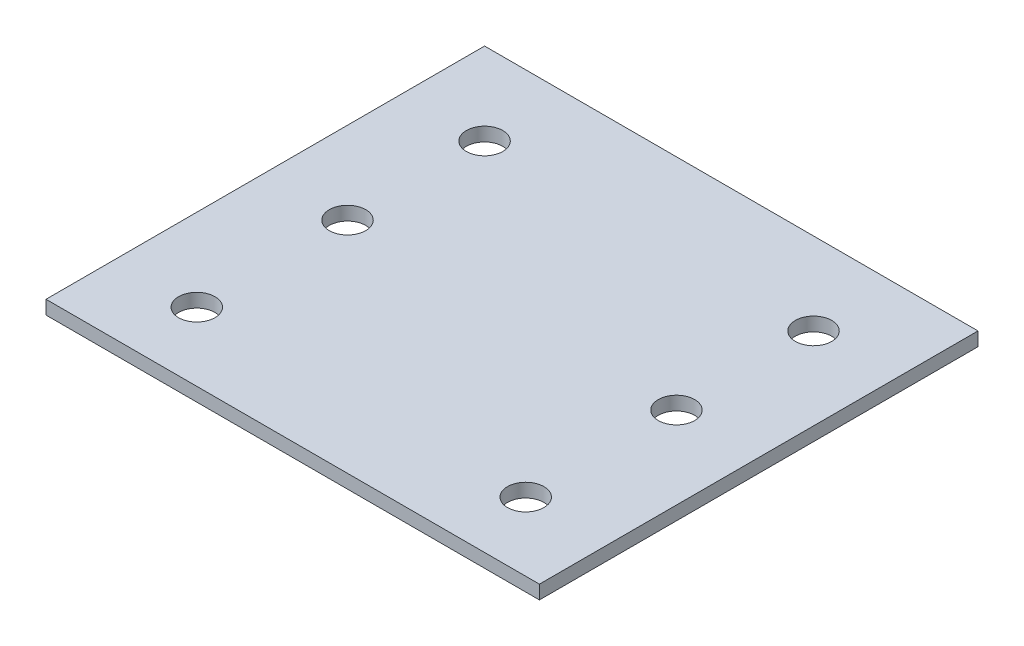
ISO-10303-21;
HEADER;
FILE_DESCRIPTION(('STEP AP214'),'2;1');
FILE_NAME('part.step','',(''),(''),'','','');
FILE_SCHEMA(('AUTOMOTIVE_DESIGN { 1 0 10303 214 1 1 1 1 }'));
ENDSEC;
DATA;
#1=APPLICATION_CONTEXT('core data for automotive mechanical design processes');
#2=APPLICATION_PROTOCOL_DEFINITION('international standard','automotive_design',2000,#1);
#3=PRODUCT_CONTEXT('',#1,'mechanical');
#4=PRODUCT('Part','Part','',(#3));
#5=PRODUCT_RELATED_PRODUCT_CATEGORY('part','',(#4));
#6=PRODUCT_DEFINITION_FORMATION('','',#4);
#7=PRODUCT_DEFINITION_CONTEXT('part definition',#1,'design');
#8=PRODUCT_DEFINITION('design','',#6,#7);
#9=PRODUCT_DEFINITION_SHAPE('','',#8);
#10=(LENGTH_UNIT() NAMED_UNIT(*) SI_UNIT(.MILLI.,.METRE.));
#11=(NAMED_UNIT(*) PLANE_ANGLE_UNIT() SI_UNIT($,.RADIAN.));
#12=(NAMED_UNIT(*) SI_UNIT($,.STERADIAN.) SOLID_ANGLE_UNIT());
#13=UNCERTAINTY_MEASURE_WITH_UNIT(LENGTH_MEASURE(1.E-05),#10,'distance_accuracy_value','');
#14=(GEOMETRIC_REPRESENTATION_CONTEXT(3) GLOBAL_UNCERTAINTY_ASSIGNED_CONTEXT((#13)) GLOBAL_UNIT_ASSIGNED_CONTEXT((#10,
#11,#12)) REPRESENTATION_CONTEXT('',''));
#15=CARTESIAN_POINT('',(0.,0.,0.));
#16=DIRECTION('',(0.,0.,1.));
#17=DIRECTION('',(1.,0.,0.));
#18=AXIS2_PLACEMENT_3D('',#15,#16,#17);
#19=CARTESIAN_POINT('',(57.15,3.175,-50.8));
#20=DIRECTION('',(-1.,0.,0.));
#21=DIRECTION('',(0.,0.,1.));
#22=AXIS2_PLACEMENT_3D('',#19,#20,#21);
#23=PLANE('',#22);
#24=DIRECTION('',(0.,0.,-1.));
#25=VECTOR('',#24,1.);
#26=CARTESIAN_POINT('',(57.15,0.,-50.8));
#27=LINE('',#26,#25);
#28=CARTESIAN_POINT('',(57.15,0.,50.8));
#29=VERTEX_POINT('',#28);
#30=CARTESIAN_POINT('',(57.15,0.,-50.8));
#31=VERTEX_POINT('',#30);
#32=EDGE_CURVE('E102',#29,#31,#27,.T.);
#33=ORIENTED_EDGE('',*,*,#32,.T.);
#34=DIRECTION('',(0.,-1.,0.));
#35=VECTOR('',#34,1.);
#36=CARTESIAN_POINT('',(57.15,3.175,-50.8));
#37=LINE('',#36,#35);
#38=CARTESIAN_POINT('',(57.15,3.175,-50.8));
#39=VERTEX_POINT('',#38);
#40=EDGE_CURVE('E11',#39,#31,#37,.T.);
#41=ORIENTED_EDGE('',*,*,#40,.F.);
#42=DIRECTION('',(0.,0.,-1.));
#43=VECTOR('',#42,1.);
#44=CARTESIAN_POINT('',(57.15,3.175,-50.8));
#45=LINE('',#44,#43);
#46=CARTESIAN_POINT('',(57.15,3.175,50.8));
#47=VERTEX_POINT('',#46);
#48=EDGE_CURVE('E90',#47,#39,#45,.T.);
#49=ORIENTED_EDGE('',*,*,#48,.F.);
#50=DIRECTION('',(0.,-1.,0.));
#51=VECTOR('',#50,1.);
#52=CARTESIAN_POINT('',(57.15,3.175,50.8));
#53=LINE('',#52,#51);
#54=EDGE_CURVE('E98',#47,#29,#53,.T.);
#55=ORIENTED_EDGE('',*,*,#54,.T.);
#56=EDGE_LOOP('',(#33,#41,#49,#55));
#57=FACE_BOUND('',#56,.T.);
#58=ADVANCED_FACE('F39',(#57),#23,.F.);
#59=CARTESIAN_POINT('',(-57.15,3.175,-50.8));
#60=DIRECTION('',(0.,0.,1.));
#61=DIRECTION('',(1.,0.,0.));
#62=AXIS2_PLACEMENT_3D('',#59,#60,#61);
#63=PLANE('',#62);
#64=DIRECTION('',(-1.,0.,0.));
#65=VECTOR('',#64,1.);
#66=CARTESIAN_POINT('',(-57.15,0.,-50.8));
#67=LINE('',#66,#65);
#68=CARTESIAN_POINT('',(-57.15,0.,-50.8));
#69=VERTEX_POINT('',#68);
#70=EDGE_CURVE('E94',#31,#69,#67,.T.);
#71=ORIENTED_EDGE('',*,*,#70,.T.);
#72=DIRECTION('',(0.,-1.,0.));
#73=VECTOR('',#72,1.);
#74=CARTESIAN_POINT('',(-57.15,3.175,-50.8));
#75=LINE('',#74,#73);
#76=CARTESIAN_POINT('',(-57.15,3.175,-50.8));
#77=VERTEX_POINT('',#76);
#78=EDGE_CURVE('E47',#77,#69,#75,.T.);
#79=ORIENTED_EDGE('',*,*,#78,.F.);
#80=DIRECTION('',(-1.,0.,0.));
#81=VECTOR('',#80,1.);
#82=CARTESIAN_POINT('',(-57.15,3.175,-50.8));
#83=LINE('',#82,#81);
#84=EDGE_CURVE('E85',#39,#77,#83,.T.);
#85=ORIENTED_EDGE('',*,*,#84,.F.);
#86=ORIENTED_EDGE('',*,*,#40,.T.);
#87=EDGE_LOOP('',(#71,#79,#85,#86));
#88=FACE_BOUND('',#87,.T.);
#89=ADVANCED_FACE('F93',(#88),#63,.F.);
#90=CARTESIAN_POINT('',(-57.15,3.175,-50.8));
#91=DIRECTION('',(1.,0.,0.));
#92=DIRECTION('',(0.,0.,-1.));
#93=AXIS2_PLACEMENT_3D('',#90,#91,#92);
#94=PLANE('',#93);
#95=DIRECTION('',(0.,0.,1.));
#96=VECTOR('',#95,1.);
#97=CARTESIAN_POINT('',(-57.15,0.,-50.8));
#98=LINE('',#97,#96);
#99=CARTESIAN_POINT('',(-57.15,0.,50.8));
#100=VERTEX_POINT('',#99);
#101=EDGE_CURVE('E72',#69,#100,#98,.T.);
#102=ORIENTED_EDGE('',*,*,#101,.T.);
#103=DIRECTION('',(0.,-1.,0.));
#104=VECTOR('',#103,1.);
#105=CARTESIAN_POINT('',(-57.15,3.175,50.8));
#106=LINE('',#105,#104);
#107=CARTESIAN_POINT('',(-57.15,3.175,50.8));
#108=VERTEX_POINT('',#107);
#109=EDGE_CURVE('E95',#108,#100,#106,.T.);
#110=ORIENTED_EDGE('',*,*,#109,.F.);
#111=DIRECTION('',(0.,0.,1.));
#112=VECTOR('',#111,1.);
#113=CARTESIAN_POINT('',(-57.15,3.175,-50.8));
#114=LINE('',#113,#112);
#115=EDGE_CURVE('E88',#77,#108,#114,.T.);
#116=ORIENTED_EDGE('',*,*,#115,.F.);
#117=ORIENTED_EDGE('',*,*,#78,.T.);
#118=EDGE_LOOP('',(#102,#110,#116,#117));
#119=FACE_BOUND('',#118,.T.);
#120=ADVANCED_FACE('F96',(#119),#94,.F.);
#121=CARTESIAN_POINT('',(-57.15,3.175,50.8));
#122=DIRECTION('',(0.,0.,-1.));
#123=DIRECTION('',(-1.,0.,0.));
#124=AXIS2_PLACEMENT_3D('',#121,#122,#123);
#125=PLANE('',#124);
#126=DIRECTION('',(1.,0.,0.));
#127=VECTOR('',#126,1.);
#128=CARTESIAN_POINT('',(-57.15,0.,50.8));
#129=LINE('',#128,#127);
#130=EDGE_CURVE('E78',#100,#29,#129,.T.);
#131=ORIENTED_EDGE('',*,*,#130,.T.);
#132=ORIENTED_EDGE('',*,*,#54,.F.);
#133=DIRECTION('',(1.,0.,0.));
#134=VECTOR('',#133,1.);
#135=CARTESIAN_POINT('',(-57.15,3.175,50.8));
#136=LINE('',#135,#134);
#137=EDGE_CURVE('E55',#108,#47,#136,.T.);
#138=ORIENTED_EDGE('',*,*,#137,.F.);
#139=ORIENTED_EDGE('',*,*,#109,.T.);
#140=EDGE_LOOP('',(#131,#132,#138,#139));
#141=FACE_BOUND('',#140,.T.);
#142=ADVANCED_FACE('F110',(#141),#125,.F.);
#143=CARTESIAN_POINT('',(0.,3.175,0.));
#144=DIRECTION('',(0.,1.,0.));
#145=DIRECTION('',(0.,0.,1.));
#146=AXIS2_PLACEMENT_3D('',#143,#144,#145);
#147=PLANE('',#146);
#148=CARTESIAN_POINT('',(38.1,3.175,-31.75));
#149=DIRECTION('',(0.,1.,0.));
#150=DIRECTION('',(0.,0.,1.));
#151=AXIS2_PLACEMENT_3D('',#148,#149,#150);
#152=CIRCLE('',#151,4.21639999999999);
#153=CARTESIAN_POINT('',(38.1,3.175,-27.5336));
#154=VERTEX_POINT('',#153);
#155=EDGE_CURVE('E148',#154,#154,#152,.T.);
#156=ORIENTED_EDGE('',*,*,#155,.F.);
#157=EDGE_LOOP('',(#156));
#158=FACE_BOUND('',#157,.T.);
#159=CARTESIAN_POINT('',(38.1,3.175,0.));
#160=DIRECTION('',(0.,1.,0.));
#161=DIRECTION('',(0.,0.,1.));
#162=AXIS2_PLACEMENT_3D('',#159,#160,#161);
#163=CIRCLE('',#162,4.21639999999999);
#164=CARTESIAN_POINT('',(38.1,3.175,4.21639999999999));
#165=VERTEX_POINT('',#164);
#166=EDGE_CURVE('E142',#165,#165,#163,.T.);
#167=ORIENTED_EDGE('',*,*,#166,.F.);
#168=EDGE_LOOP('',(#167));
#169=FACE_BOUND('',#168,.T.);
#170=CARTESIAN_POINT('',(38.1,3.175,34.925));
#171=DIRECTION('',(0.,1.,0.));
#172=DIRECTION('',(0.,0.,1.));
#173=AXIS2_PLACEMENT_3D('',#170,#171,#172);
#174=CIRCLE('',#173,4.21639999999999);
#175=CARTESIAN_POINT('',(38.1,3.175,39.1414));
#176=VERTEX_POINT('',#175);
#177=EDGE_CURVE('E136',#176,#176,#174,.T.);
#178=ORIENTED_EDGE('',*,*,#177,.F.);
#179=EDGE_LOOP('',(#178));
#180=FACE_BOUND('',#179,.T.);
#181=CARTESIAN_POINT('',(-38.1,3.175,-31.75));
#182=DIRECTION('',(0.,1.,0.));
#183=DIRECTION('',(0.,0.,1.));
#184=AXIS2_PLACEMENT_3D('',#181,#182,#183);
#185=CIRCLE('',#184,4.21639999999999);
#186=CARTESIAN_POINT('',(-38.1,3.175,-27.5336));
#187=VERTEX_POINT('',#186);
#188=EDGE_CURVE('E130',#187,#187,#185,.T.);
#189=ORIENTED_EDGE('',*,*,#188,.F.);
#190=EDGE_LOOP('',(#189));
#191=FACE_BOUND('',#190,.T.);
#192=CARTESIAN_POINT('',(-38.1,3.175,0.));
#193=DIRECTION('',(0.,1.,0.));
#194=DIRECTION('',(0.,0.,1.));
#195=AXIS2_PLACEMENT_3D('',#192,#193,#194);
#196=CIRCLE('',#195,4.21639999999999);
#197=CARTESIAN_POINT('',(-38.1,3.175,4.21639999999999));
#198=VERTEX_POINT('',#197);
#199=EDGE_CURVE('E124',#198,#198,#196,.T.);
#200=ORIENTED_EDGE('',*,*,#199,.F.);
#201=EDGE_LOOP('',(#200));
#202=FACE_BOUND('',#201,.T.);
#203=CARTESIAN_POINT('',(-38.1,3.175,34.925));
#204=DIRECTION('',(0.,1.,0.));
#205=DIRECTION('',(0.,0.,1.));
#206=AXIS2_PLACEMENT_3D('',#203,#204,#205);
#207=CIRCLE('',#206,4.21639999999999);
#208=CARTESIAN_POINT('',(-38.1,3.175,39.1414));
#209=VERTEX_POINT('',#208);
#210=EDGE_CURVE('E118',#209,#209,#207,.T.);
#211=ORIENTED_EDGE('',*,*,#210,.F.);
#212=EDGE_LOOP('',(#211));
#213=FACE_BOUND('',#212,.T.);
#214=ORIENTED_EDGE('',*,*,#48,.T.);
#215=ORIENTED_EDGE('',*,*,#84,.T.);
#216=ORIENTED_EDGE('',*,*,#115,.T.);
#217=ORIENTED_EDGE('',*,*,#137,.T.);
#218=EDGE_LOOP('',(#214,#215,#216,#217));
#219=FACE_BOUND('',#218,.T.);
#220=ADVANCED_FACE('F86',(#158,#169,#180,#191,#202,#213,#219),#147,.T.);
#221=CARTESIAN_POINT('',(0.,0.,0.));
#222=DIRECTION('',(0.,1.,0.));
#223=DIRECTION('',(0.,0.,1.));
#224=AXIS2_PLACEMENT_3D('',#221,#222,#223);
#225=PLANE('',#224);
#226=CARTESIAN_POINT('',(38.1,0.,-31.75));
#227=DIRECTION('',(0.,1.,0.));
#228=DIRECTION('',(0.,0.,1.));
#229=AXIS2_PLACEMENT_3D('',#226,#227,#228);
#230=CIRCLE('',#229,4.21639999999999);
#231=CARTESIAN_POINT('',(38.1,0.,-27.5336));
#232=VERTEX_POINT('',#231);
#233=EDGE_CURVE('E145',#232,#232,#230,.T.);
#234=ORIENTED_EDGE('',*,*,#233,.T.);
#235=EDGE_LOOP('',(#234));
#236=FACE_BOUND('',#235,.T.);
#237=CARTESIAN_POINT('',(38.1,0.,0.));
#238=DIRECTION('',(0.,1.,0.));
#239=DIRECTION('',(0.,0.,1.));
#240=AXIS2_PLACEMENT_3D('',#237,#238,#239);
#241=CIRCLE('',#240,4.21639999999999);
#242=CARTESIAN_POINT('',(38.1,0.,4.21639999999999));
#243=VERTEX_POINT('',#242);
#244=EDGE_CURVE('E139',#243,#243,#241,.T.);
#245=ORIENTED_EDGE('',*,*,#244,.T.);
#246=EDGE_LOOP('',(#245));
#247=FACE_BOUND('',#246,.T.);
#248=CARTESIAN_POINT('',(38.1,0.,34.925));
#249=DIRECTION('',(0.,1.,0.));
#250=DIRECTION('',(0.,0.,1.));
#251=AXIS2_PLACEMENT_3D('',#248,#249,#250);
#252=CIRCLE('',#251,4.21639999999999);
#253=CARTESIAN_POINT('',(38.1,0.,39.1414));
#254=VERTEX_POINT('',#253);
#255=EDGE_CURVE('E133',#254,#254,#252,.T.);
#256=ORIENTED_EDGE('',*,*,#255,.T.);
#257=EDGE_LOOP('',(#256));
#258=FACE_BOUND('',#257,.T.);
#259=CARTESIAN_POINT('',(-38.1,0.,-31.75));
#260=DIRECTION('',(0.,1.,0.));
#261=DIRECTION('',(0.,0.,1.));
#262=AXIS2_PLACEMENT_3D('',#259,#260,#261);
#263=CIRCLE('',#262,4.21639999999999);
#264=CARTESIAN_POINT('',(-38.1,0.,-27.5336));
#265=VERTEX_POINT('',#264);
#266=EDGE_CURVE('E127',#265,#265,#263,.T.);
#267=ORIENTED_EDGE('',*,*,#266,.T.);
#268=EDGE_LOOP('',(#267));
#269=FACE_BOUND('',#268,.T.);
#270=CARTESIAN_POINT('',(-38.1,0.,0.));
#271=DIRECTION('',(0.,1.,0.));
#272=DIRECTION('',(0.,0.,1.));
#273=AXIS2_PLACEMENT_3D('',#270,#271,#272);
#274=CIRCLE('',#273,4.21639999999999);
#275=CARTESIAN_POINT('',(-38.1,0.,4.21639999999999));
#276=VERTEX_POINT('',#275);
#277=EDGE_CURVE('E121',#276,#276,#274,.T.);
#278=ORIENTED_EDGE('',*,*,#277,.T.);
#279=EDGE_LOOP('',(#278));
#280=FACE_BOUND('',#279,.T.);
#281=CARTESIAN_POINT('',(-38.1,0.,34.925));
#282=DIRECTION('',(0.,1.,0.));
#283=DIRECTION('',(0.,0.,1.));
#284=AXIS2_PLACEMENT_3D('',#281,#282,#283);
#285=CIRCLE('',#284,4.21639999999999);
#286=CARTESIAN_POINT('',(-38.1,0.,39.1414));
#287=VERTEX_POINT('',#286);
#288=EDGE_CURVE('E105',#287,#287,#285,.T.);
#289=ORIENTED_EDGE('',*,*,#288,.T.);
#290=EDGE_LOOP('',(#289));
#291=FACE_BOUND('',#290,.T.);
#292=ORIENTED_EDGE('',*,*,#32,.F.);
#293=ORIENTED_EDGE('',*,*,#130,.F.);
#294=ORIENTED_EDGE('',*,*,#101,.F.);
#295=ORIENTED_EDGE('',*,*,#70,.F.);
#296=EDGE_LOOP('',(#292,#293,#294,#295));
#297=FACE_BOUND('',#296,.T.);
#298=ADVANCED_FACE('F113',(#236,#247,#258,#269,#280,#291,#297),#225,.F.);
#299=CARTESIAN_POINT('',(-38.1,3.175,34.925));
#300=DIRECTION('',(0.,1.,0.));
#301=DIRECTION('',(0.,0.,1.));
#302=AXIS2_PLACEMENT_3D('',#299,#300,#301);
#303=CYLINDRICAL_SURFACE('',#302,4.21639999999999);
#304=ORIENTED_EDGE('',*,*,#288,.F.);
#305=EDGE_LOOP('',(#304));
#306=FACE_BOUND('',#305,.T.);
#307=ORIENTED_EDGE('',*,*,#210,.T.);
#308=EDGE_LOOP('',(#307));
#309=FACE_BOUND('',#308,.T.);
#310=ADVANCED_FACE('F167',(#306,#309),#303,.F.);
#311=CARTESIAN_POINT('',(-38.1,3.175,0.));
#312=DIRECTION('',(0.,1.,0.));
#313=DIRECTION('',(0.,0.,1.));
#314=AXIS2_PLACEMENT_3D('',#311,#312,#313);
#315=CYLINDRICAL_SURFACE('',#314,4.21639999999999);
#316=ORIENTED_EDGE('',*,*,#277,.F.);
#317=EDGE_LOOP('',(#316));
#318=FACE_BOUND('',#317,.T.);
#319=ORIENTED_EDGE('',*,*,#199,.T.);
#320=EDGE_LOOP('',(#319));
#321=FACE_BOUND('',#320,.T.);
#322=ADVANCED_FACE('F169',(#318,#321),#315,.F.);
#323=CARTESIAN_POINT('',(-38.1,3.175,-31.75));
#324=DIRECTION('',(0.,1.,0.));
#325=DIRECTION('',(0.,0.,1.));
#326=AXIS2_PLACEMENT_3D('',#323,#324,#325);
#327=CYLINDRICAL_SURFACE('',#326,4.21639999999999);
#328=ORIENTED_EDGE('',*,*,#266,.F.);
#329=EDGE_LOOP('',(#328));
#330=FACE_BOUND('',#329,.T.);
#331=ORIENTED_EDGE('',*,*,#188,.T.);
#332=EDGE_LOOP('',(#331));
#333=FACE_BOUND('',#332,.T.);
#334=ADVANCED_FACE('F176',(#330,#333),#327,.F.);
#335=CARTESIAN_POINT('',(38.1,3.175,34.925));
#336=DIRECTION('',(0.,1.,0.));
#337=DIRECTION('',(0.,0.,1.));
#338=AXIS2_PLACEMENT_3D('',#335,#336,#337);
#339=CYLINDRICAL_SURFACE('',#338,4.21639999999999);
#340=ORIENTED_EDGE('',*,*,#255,.F.);
#341=EDGE_LOOP('',(#340));
#342=FACE_BOUND('',#341,.T.);
#343=ORIENTED_EDGE('',*,*,#177,.T.);
#344=EDGE_LOOP('',(#343));
#345=FACE_BOUND('',#344,.T.);
#346=ADVANCED_FACE('F213',(#342,#345),#339,.F.);
#347=CARTESIAN_POINT('',(38.1,3.175,0.));
#348=DIRECTION('',(0.,1.,0.));
#349=DIRECTION('',(0.,0.,1.));
#350=AXIS2_PLACEMENT_3D('',#347,#348,#349);
#351=CYLINDRICAL_SURFACE('',#350,4.21639999999999);
#352=ORIENTED_EDGE('',*,*,#244,.F.);
#353=EDGE_LOOP('',(#352));
#354=FACE_BOUND('',#353,.T.);
#355=ORIENTED_EDGE('',*,*,#166,.T.);
#356=EDGE_LOOP('',(#355));
#357=FACE_BOUND('',#356,.T.);
#358=ADVANCED_FACE('F218',(#354,#357),#351,.F.);
#359=CARTESIAN_POINT('',(38.1,3.175,-31.75));
#360=DIRECTION('',(0.,1.,0.));
#361=DIRECTION('',(0.,0.,1.));
#362=AXIS2_PLACEMENT_3D('',#359,#360,#361);
#363=CYLINDRICAL_SURFACE('',#362,4.21639999999999);
#364=ORIENTED_EDGE('',*,*,#233,.F.);
#365=EDGE_LOOP('',(#364));
#366=FACE_BOUND('',#365,.T.);
#367=ORIENTED_EDGE('',*,*,#155,.T.);
#368=EDGE_LOOP('',(#367));
#369=FACE_BOUND('',#368,.T.);
#370=ADVANCED_FACE('F152',(#366,#369),#363,.F.);
#371=CLOSED_SHELL('',(#58,#89,#120,#142,#220,#298,#310,#322,#334,#346,#358,#370));
#372=MANIFOLD_SOLID_BREP('B2',#371);
#373=ADVANCED_BREP_SHAPE_REPRESENTATION('',(#18,#372),#14);
#374=SHAPE_DEFINITION_REPRESENTATION(#9,#373);
ENDSEC;
END-ISO-10303-21;
